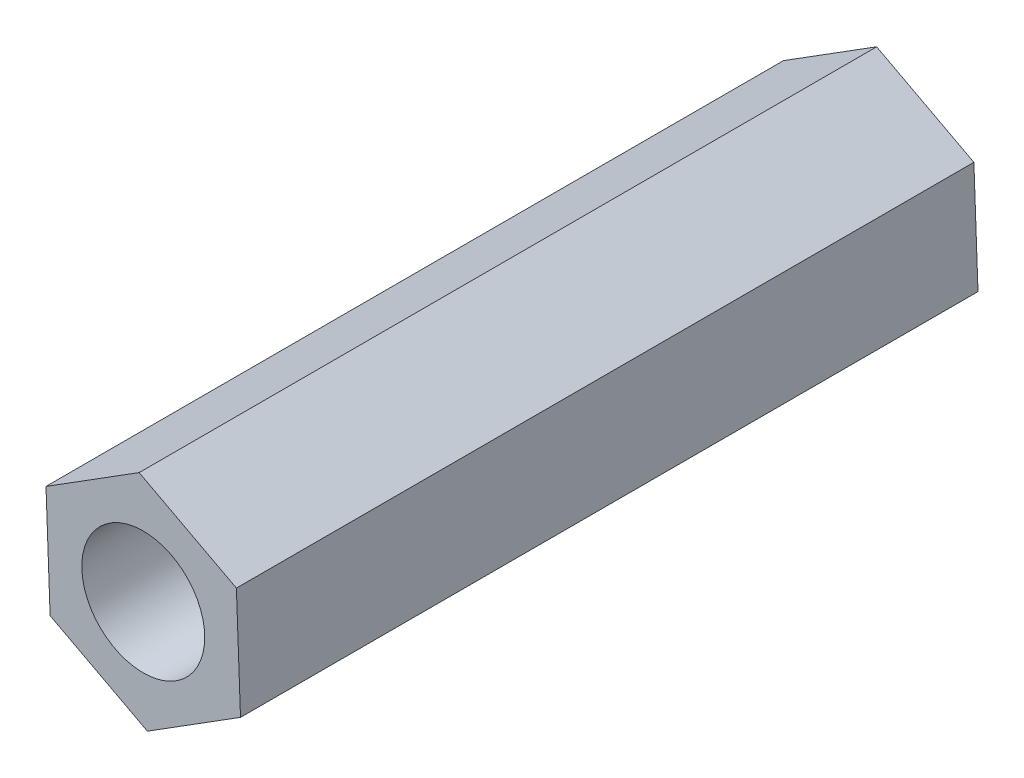
ISO-10303-21;
HEADER;
FILE_DESCRIPTION(('STEP AP214'),'2;1');
FILE_NAME('part.step','',(''),(''),'','','');
FILE_SCHEMA(('AUTOMOTIVE_DESIGN { 1 0 10303 214 1 1 1 1 }'));
ENDSEC;
DATA;
#1=APPLICATION_CONTEXT('core data for automotive mechanical design processes');
#2=APPLICATION_PROTOCOL_DEFINITION('international standard','automotive_design',2000,#1);
#3=PRODUCT_CONTEXT('',#1,'mechanical');
#4=PRODUCT('Part','Part','',(#3));
#5=PRODUCT_RELATED_PRODUCT_CATEGORY('part','',(#4));
#6=PRODUCT_DEFINITION_FORMATION('','',#4);
#7=PRODUCT_DEFINITION_CONTEXT('part definition',#1,'design');
#8=PRODUCT_DEFINITION('design','',#6,#7);
#9=PRODUCT_DEFINITION_SHAPE('','',#8);
#10=(LENGTH_UNIT() NAMED_UNIT(*) SI_UNIT(.MILLI.,.METRE.));
#11=(NAMED_UNIT(*) PLANE_ANGLE_UNIT() SI_UNIT($,.RADIAN.));
#12=(NAMED_UNIT(*) SI_UNIT($,.STERADIAN.) SOLID_ANGLE_UNIT());
#13=UNCERTAINTY_MEASURE_WITH_UNIT(LENGTH_MEASURE(1.E-05),#10,'distance_accuracy_value','');
#14=(GEOMETRIC_REPRESENTATION_CONTEXT(3) GLOBAL_UNCERTAINTY_ASSIGNED_CONTEXT((#13)) GLOBAL_UNIT_ASSIGNED_CONTEXT((#10,
#11,#12)) REPRESENTATION_CONTEXT('',''));
#15=CARTESIAN_POINT('',(0.,0.,0.));
#16=DIRECTION('',(0.,0.,1.));
#17=DIRECTION('',(1.,0.,0.));
#18=AXIS2_PLACEMENT_3D('',#15,#16,#17);
#19=CARTESIAN_POINT('',(0.,0.,18.));
#20=DIRECTION('',(0.,0.,1.));
#21=DIRECTION('',(1.,0.,0.));
#22=AXIS2_PLACEMENT_3D('',#19,#20,#21);
#23=PLANE('',#22);
#24=DIRECTION('',(-0.0373746720524852,0.999301322869618,0.));
#25=VECTOR('',#24,1.);
#26=CARTESIAN_POINT('',(2.37354506962798,-1.25450540152072,18.));
#27=LINE('',#26,#25);
#28=CARTESIAN_POINT('',(2.37354506962798,-1.25450540152072,18.));
#29=VERTEX_POINT('',#28);
#30=CARTESIAN_POINT('',(2.27320608171573,1.42829762656477,18.));
#31=VERTEX_POINT('',#30);
#32=EDGE_CURVE('E131',#29,#31,#27,.T.);
#33=ORIENTED_EDGE('',*,*,#32,.T.);
#34=DIRECTION('',(-0.884107667666727,0.467283245979245,0.));
#35=VECTOR('',#34,1.);
#36=CARTESIAN_POINT('',(2.27320608171573,1.42829762656477,18.));
#37=LINE('',#36,#35);
#38=CARTESIAN_POINT('',(-0.100338987912251,2.68280302808549,18.));
#39=VERTEX_POINT('',#38);
#40=EDGE_CURVE('E89',#31,#39,#37,.T.);
#41=ORIENTED_EDGE('',*,*,#40,.T.);
#42=DIRECTION('',(-0.846732995614242,-0.532018076890375,0.));
#43=VECTOR('',#42,1.);
#44=CARTESIAN_POINT('',(-0.100338987912251,2.68280302808549,18.));
#45=LINE('',#44,#43);
#46=CARTESIAN_POINT('',(-2.37354506962798,1.25450540152072,18.));
#47=VERTEX_POINT('',#46);
#48=EDGE_CURVE('E102',#39,#47,#45,.T.);
#49=ORIENTED_EDGE('',*,*,#48,.T.);
#50=DIRECTION('',(0.0373746720524864,-0.999301322869618,0.));
#51=VECTOR('',#50,1.);
#52=CARTESIAN_POINT('',(-2.37354506962798,1.25450540152072,18.));
#53=LINE('',#52,#51);
#54=CARTESIAN_POINT('',(-2.27320608171573,-1.42829762656478,18.));
#55=VERTEX_POINT('',#54);
#56=EDGE_CURVE('E96',#47,#55,#53,.T.);
#57=ORIENTED_EDGE('',*,*,#56,.T.);
#58=DIRECTION('',(0.884107667666728,-0.467283245979244,0.));
#59=VECTOR('',#58,1.);
#60=CARTESIAN_POINT('',(-2.27320608171573,-1.42829762656478,18.));
#61=LINE('',#60,#59);
#62=CARTESIAN_POINT('',(0.100338987912251,-2.68280302808549,18.));
#63=VERTEX_POINT('',#62);
#64=EDGE_CURVE('E100',#55,#63,#61,.T.);
#65=ORIENTED_EDGE('',*,*,#64,.T.);
#66=DIRECTION('',(0.846732995614242,0.532018076890374,0.));
#67=VECTOR('',#66,1.);
#68=CARTESIAN_POINT('',(0.100338987912251,-2.68280302808549,18.));
#69=LINE('',#68,#67);
#70=EDGE_CURVE('E52',#63,#29,#69,.T.);
#71=ORIENTED_EDGE('',*,*,#70,.T.);
#72=EDGE_LOOP('',(#33,#41,#49,#57,#65,#71));
#73=FACE_BOUND('',#72,.T.);
#74=CARTESIAN_POINT('',(0.,0.,18.));
#75=DIRECTION('',(0.,0.,1.));
#76=DIRECTION('',(1.,0.,0.));
#77=AXIS2_PLACEMENT_3D('',#74,#75,#76);
#78=CIRCLE('',#77,1.5);
#79=CARTESIAN_POINT('',(1.5,0.,18.));
#80=VERTEX_POINT('',#79);
#81=EDGE_CURVE('E124',#80,#80,#78,.T.);
#82=ORIENTED_EDGE('',*,*,#81,.F.);
#83=EDGE_LOOP('',(#82));
#84=FACE_BOUND('',#83,.T.);
#85=ADVANCED_FACE('F35',(#73,#84),#23,.T.);
#86=CARTESIAN_POINT('',(0.,0.,0.));
#87=DIRECTION('',(0.,0.,1.));
#88=DIRECTION('',(1.,0.,0.));
#89=AXIS2_PLACEMENT_3D('',#86,#87,#88);
#90=PLANE('',#89);
#91=DIRECTION('',(-0.0373746720524852,0.999301322869618,0.));
#92=VECTOR('',#91,1.);
#93=CARTESIAN_POINT('',(2.37354506962798,-1.25450540152072,0.));
#94=LINE('',#93,#92);
#95=CARTESIAN_POINT('',(2.37354506962798,-1.25450540152072,0.));
#96=VERTEX_POINT('',#95);
#97=CARTESIAN_POINT('',(2.27320608171573,1.42829762656477,0.));
#98=VERTEX_POINT('',#97);
#99=EDGE_CURVE('E120',#96,#98,#94,.T.);
#100=ORIENTED_EDGE('',*,*,#99,.F.);
#101=DIRECTION('',(0.846732995614242,0.532018076890374,0.));
#102=VECTOR('',#101,1.);
#103=CARTESIAN_POINT('',(0.100338987912251,-2.68280302808549,0.));
#104=LINE('',#103,#102);
#105=CARTESIAN_POINT('',(0.100338987912251,-2.68280302808549,0.));
#106=VERTEX_POINT('',#105);
#107=EDGE_CURVE('E81',#106,#96,#104,.T.);
#108=ORIENTED_EDGE('',*,*,#107,.F.);
#109=DIRECTION('',(0.884107667666728,-0.467283245979244,0.));
#110=VECTOR('',#109,1.);
#111=CARTESIAN_POINT('',(-2.27320608171573,-1.42829762656478,0.));
#112=LINE('',#111,#110);
#113=CARTESIAN_POINT('',(-2.27320608171573,-1.42829762656478,0.));
#114=VERTEX_POINT('',#113);
#115=EDGE_CURVE('E75',#114,#106,#112,.T.);
#116=ORIENTED_EDGE('',*,*,#115,.F.);
#117=DIRECTION('',(0.0373746720524864,-0.999301322869618,0.));
#118=VECTOR('',#117,1.);
#119=CARTESIAN_POINT('',(-2.37354506962798,1.25450540152072,0.));
#120=LINE('',#119,#118);
#121=CARTESIAN_POINT('',(-2.37354506962798,1.25450540152072,0.));
#122=VERTEX_POINT('',#121);
#123=EDGE_CURVE('E110',#122,#114,#120,.T.);
#124=ORIENTED_EDGE('',*,*,#123,.F.);
#125=DIRECTION('',(-0.846732995614242,-0.532018076890375,0.));
#126=VECTOR('',#125,1.);
#127=CARTESIAN_POINT('',(-0.100338987912251,2.68280302808549,0.));
#128=LINE('',#127,#126);
#129=CARTESIAN_POINT('',(-0.100338987912251,2.68280302808549,0.));
#130=VERTEX_POINT('',#129);
#131=EDGE_CURVE('E126',#130,#122,#128,.T.);
#132=ORIENTED_EDGE('',*,*,#131,.F.);
#133=DIRECTION('',(-0.884107667666727,0.467283245979245,0.));
#134=VECTOR('',#133,1.);
#135=CARTESIAN_POINT('',(2.27320608171573,1.42829762656477,0.));
#136=LINE('',#135,#134);
#137=EDGE_CURVE('E123',#98,#130,#136,.T.);
#138=ORIENTED_EDGE('',*,*,#137,.F.);
#139=EDGE_LOOP('',(#100,#108,#116,#124,#132,#138));
#140=FACE_BOUND('',#139,.T.);
#141=CARTESIAN_POINT('',(0.,0.,0.));
#142=DIRECTION('',(0.,0.,1.));
#143=DIRECTION('',(1.,0.,0.));
#144=AXIS2_PLACEMENT_3D('',#141,#142,#143);
#145=CIRCLE('',#144,1.5);
#146=CARTESIAN_POINT('',(1.5,0.,0.));
#147=VERTEX_POINT('',#146);
#148=EDGE_CURVE('E224',#147,#147,#145,.T.);
#149=ORIENTED_EDGE('',*,*,#148,.T.);
#150=EDGE_LOOP('',(#149));
#151=FACE_BOUND('',#150,.T.);
#152=ADVANCED_FACE('F140',(#140,#151),#90,.F.);
#153=CARTESIAN_POINT('',(2.37354506962798,-1.25450540152072,18.));
#154=DIRECTION('',(-0.999301322869618,-0.0373746720524852,0.));
#155=DIRECTION('',(0.0373746720524852,-0.999301322869618,0.));
#156=AXIS2_PLACEMENT_3D('',#153,#154,#155);
#157=PLANE('',#156);
#158=ORIENTED_EDGE('',*,*,#99,.T.);
#159=DIRECTION('',(0.,0.,-1.));
#160=VECTOR('',#159,1.);
#161=CARTESIAN_POINT('',(2.27320608171573,1.42829762656477,18.));
#162=LINE('',#161,#160);
#163=EDGE_CURVE('E11',#31,#98,#162,.T.);
#164=ORIENTED_EDGE('',*,*,#163,.F.);
#165=ORIENTED_EDGE('',*,*,#32,.F.);
#166=DIRECTION('',(0.,0.,-1.));
#167=VECTOR('',#166,1.);
#168=CARTESIAN_POINT('',(2.37354506962798,-1.25450540152072,18.));
#169=LINE('',#168,#167);
#170=EDGE_CURVE('E116',#29,#96,#169,.T.);
#171=ORIENTED_EDGE('',*,*,#170,.T.);
#172=EDGE_LOOP('',(#158,#164,#165,#171));
#173=FACE_BOUND('',#172,.T.);
#174=ADVANCED_FACE('F37',(#173),#157,.F.);
#175=CARTESIAN_POINT('',(2.27320608171573,1.42829762656477,18.));
#176=DIRECTION('',(-0.467283245979245,-0.884107667666727,0.));
#177=DIRECTION('',(0.884107667666727,-0.467283245979245,0.));
#178=AXIS2_PLACEMENT_3D('',#175,#176,#177);
#179=PLANE('',#178);
#180=ORIENTED_EDGE('',*,*,#137,.T.);
#181=DIRECTION('',(0.,0.,-1.));
#182=VECTOR('',#181,1.);
#183=CARTESIAN_POINT('',(-0.100338987912251,2.68280302808549,18.));
#184=LINE('',#183,#182);
#185=EDGE_CURVE('E44',#39,#130,#184,.T.);
#186=ORIENTED_EDGE('',*,*,#185,.F.);
#187=ORIENTED_EDGE('',*,*,#40,.F.);
#188=ORIENTED_EDGE('',*,*,#163,.T.);
#189=EDGE_LOOP('',(#180,#186,#187,#188));
#190=FACE_BOUND('',#189,.T.);
#191=ADVANCED_FACE('F165',(#190),#179,.F.);
#192=CARTESIAN_POINT('',(-0.100338987912251,2.68280302808549,18.));
#193=DIRECTION('',(0.532018076890375,-0.846732995614242,0.));
#194=DIRECTION('',(0.846732995614242,0.532018076890375,0.));
#195=AXIS2_PLACEMENT_3D('',#192,#193,#194);
#196=PLANE('',#195);
#197=ORIENTED_EDGE('',*,*,#131,.T.);
#198=DIRECTION('',(0.,0.,-1.));
#199=VECTOR('',#198,1.);
#200=CARTESIAN_POINT('',(-2.37354506962798,1.25450540152072,18.));
#201=LINE('',#200,#199);
#202=EDGE_CURVE('E111',#47,#122,#201,.T.);
#203=ORIENTED_EDGE('',*,*,#202,.F.);
#204=ORIENTED_EDGE('',*,*,#48,.F.);
#205=ORIENTED_EDGE('',*,*,#185,.T.);
#206=EDGE_LOOP('',(#197,#203,#204,#205));
#207=FACE_BOUND('',#206,.T.);
#208=ADVANCED_FACE('F137',(#207),#196,.F.);
#209=CARTESIAN_POINT('',(-2.37354506962798,1.25450540152072,18.));
#210=DIRECTION('',(0.999301322869618,0.0373746720524864,0.));
#211=DIRECTION('',(-0.0373746720524864,0.999301322869618,0.));
#212=AXIS2_PLACEMENT_3D('',#209,#210,#211);
#213=PLANE('',#212);
#214=ORIENTED_EDGE('',*,*,#123,.T.);
#215=DIRECTION('',(0.,0.,-1.));
#216=VECTOR('',#215,1.);
#217=CARTESIAN_POINT('',(-2.27320608171573,-1.42829762656478,18.));
#218=LINE('',#217,#216);
#219=EDGE_CURVE('E107',#55,#114,#218,.T.);
#220=ORIENTED_EDGE('',*,*,#219,.F.);
#221=ORIENTED_EDGE('',*,*,#56,.F.);
#222=ORIENTED_EDGE('',*,*,#202,.T.);
#223=EDGE_LOOP('',(#214,#220,#221,#222));
#224=FACE_BOUND('',#223,.T.);
#225=ADVANCED_FACE('F108',(#224),#213,.F.);
#226=CARTESIAN_POINT('',(-2.27320608171573,-1.42829762656478,18.));
#227=DIRECTION('',(0.467283245979244,0.884107667666728,0.));
#228=DIRECTION('',(-0.884107667666728,0.467283245979244,0.));
#229=AXIS2_PLACEMENT_3D('',#226,#227,#228);
#230=PLANE('',#229);
#231=ORIENTED_EDGE('',*,*,#115,.T.);
#232=DIRECTION('',(0.,0.,-1.));
#233=VECTOR('',#232,1.);
#234=CARTESIAN_POINT('',(0.100338987912251,-2.68280302808549,18.));
#235=LINE('',#234,#233);
#236=EDGE_CURVE('E112',#63,#106,#235,.T.);
#237=ORIENTED_EDGE('',*,*,#236,.F.);
#238=ORIENTED_EDGE('',*,*,#64,.F.);
#239=ORIENTED_EDGE('',*,*,#219,.T.);
#240=EDGE_LOOP('',(#231,#237,#238,#239));
#241=FACE_BOUND('',#240,.T.);
#242=ADVANCED_FACE('F114',(#241),#230,.F.);
#243=CARTESIAN_POINT('',(0.100338987912251,-2.68280302808549,18.));
#244=DIRECTION('',(-0.532018076890374,0.846732995614242,0.));
#245=DIRECTION('',(-0.846732995614242,-0.532018076890374,0.));
#246=AXIS2_PLACEMENT_3D('',#243,#244,#245);
#247=PLANE('',#246);
#248=ORIENTED_EDGE('',*,*,#107,.T.);
#249=ORIENTED_EDGE('',*,*,#170,.F.);
#250=ORIENTED_EDGE('',*,*,#70,.F.);
#251=ORIENTED_EDGE('',*,*,#236,.T.);
#252=EDGE_LOOP('',(#248,#249,#250,#251));
#253=FACE_BOUND('',#252,.T.);
#254=ADVANCED_FACE('F145',(#253),#247,.F.);
#255=CARTESIAN_POINT('',(0.,0.,18.));
#256=DIRECTION('',(0.,0.,-1.));
#257=DIRECTION('',(-1.,0.,0.));
#258=AXIS2_PLACEMENT_3D('',#255,#256,#257);
#259=CYLINDRICAL_SURFACE('',#258,1.5);
#260=ORIENTED_EDGE('',*,*,#81,.T.);
#261=EDGE_LOOP('',(#260));
#262=FACE_BOUND('',#261,.T.);
#263=ORIENTED_EDGE('',*,*,#148,.F.);
#264=EDGE_LOOP('',(#263));
#265=FACE_BOUND('',#264,.T.);
#266=ADVANCED_FACE('F147',(#262,#265),#259,.F.);
#267=CLOSED_SHELL('',(#85,#152,#174,#191,#208,#225,#242,#254,#266));
#268=MANIFOLD_SOLID_BREP('B2',#267);
#269=ADVANCED_BREP_SHAPE_REPRESENTATION('',(#18,#268),#14);
#270=SHAPE_DEFINITION_REPRESENTATION(#9,#269);
ENDSEC;
END-ISO-10303-21;
